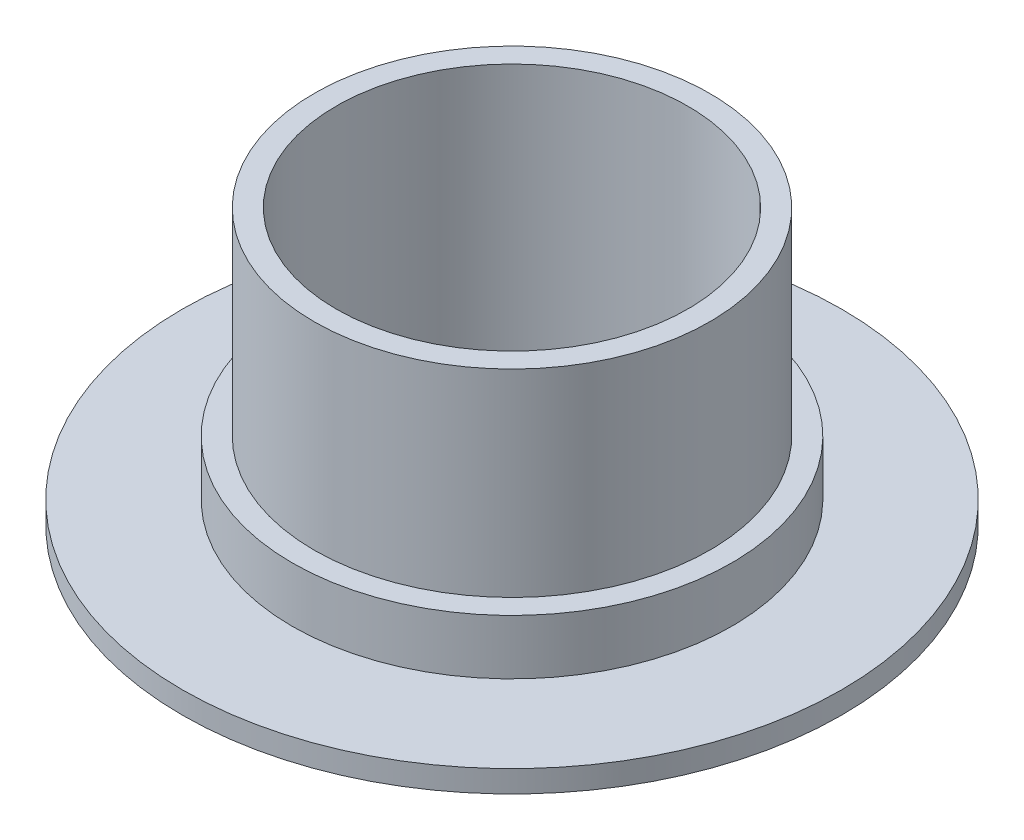
ISO-10303-21;
HEADER;
FILE_DESCRIPTION(('STEP AP214'),'2;1');
FILE_NAME('part.step','',(''),(''),'','','');
FILE_SCHEMA(('AUTOMOTIVE_DESIGN { 1 0 10303 214 1 1 1 1 }'));
ENDSEC;
DATA;
#1=APPLICATION_CONTEXT('core data for automotive mechanical design processes');
#2=APPLICATION_PROTOCOL_DEFINITION('international standard','automotive_design',2000,#1);
#3=PRODUCT_CONTEXT('',#1,'mechanical');
#4=PRODUCT('Part','Part','',(#3));
#5=PRODUCT_RELATED_PRODUCT_CATEGORY('part','',(#4));
#6=PRODUCT_DEFINITION_FORMATION('','',#4);
#7=PRODUCT_DEFINITION_CONTEXT('part definition',#1,'design');
#8=PRODUCT_DEFINITION('design','',#6,#7);
#9=PRODUCT_DEFINITION_SHAPE('','',#8);
#10=(LENGTH_UNIT() NAMED_UNIT(*) SI_UNIT(.MILLI.,.METRE.));
#11=(NAMED_UNIT(*) PLANE_ANGLE_UNIT() SI_UNIT($,.RADIAN.));
#12=(NAMED_UNIT(*) SI_UNIT($,.STERADIAN.) SOLID_ANGLE_UNIT());
#13=UNCERTAINTY_MEASURE_WITH_UNIT(LENGTH_MEASURE(1.E-05),#10,'distance_accuracy_value','');
#14=(GEOMETRIC_REPRESENTATION_CONTEXT(3) GLOBAL_UNCERTAINTY_ASSIGNED_CONTEXT((#13)) GLOBAL_UNIT_ASSIGNED_CONTEXT((#10,
#11,#12)) REPRESENTATION_CONTEXT('',''));
#15=CARTESIAN_POINT('',(0.,0.,0.));
#16=DIRECTION('',(0.,0.,1.));
#17=DIRECTION('',(1.,0.,0.));
#18=AXIS2_PLACEMENT_3D('',#15,#16,#17);
#19=CARTESIAN_POINT('',(0.,2.,0.));
#20=DIRECTION('',(0.,1.,0.));
#21=DIRECTION('',(0.,0.,1.));
#22=AXIS2_PLACEMENT_3D('',#19,#20,#21);
#23=PLANE('',#22);
#24=CARTESIAN_POINT('',(0.,2.,0.));
#25=DIRECTION('',(0.,1.,0.));
#26=DIRECTION('',(0.,0.,1.));
#27=AXIS2_PLACEMENT_3D('',#24,#25,#26);
#28=CIRCLE('',#27,30.);
#29=CARTESIAN_POINT('',(0.,2.,30.));
#30=VERTEX_POINT('',#29);
#31=EDGE_CURVE('E10',#30,#30,#28,.T.);
#32=ORIENTED_EDGE('',*,*,#31,.T.);
#33=EDGE_LOOP('',(#32));
#34=FACE_BOUND('',#33,.T.);
#35=CARTESIAN_POINT('',(0.,2.,0.));
#36=DIRECTION('',(0.,1.,0.));
#37=DIRECTION('',(0.,0.,1.));
#38=AXIS2_PLACEMENT_3D('',#35,#36,#37);
#39=CIRCLE('',#38,20.);
#40=CARTESIAN_POINT('',(0.,2.,20.));
#41=VERTEX_POINT('',#40);
#42=EDGE_CURVE('E46',#41,#41,#39,.T.);
#43=ORIENTED_EDGE('',*,*,#42,.F.);
#44=EDGE_LOOP('',(#43));
#45=FACE_BOUND('',#44,.T.);
#46=ADVANCED_FACE('F35',(#34,#45),#23,.T.);
#47=CARTESIAN_POINT('',(0.,0.,0.));
#48=DIRECTION('',(0.,1.,0.));
#49=DIRECTION('',(0.,0.,1.));
#50=AXIS2_PLACEMENT_3D('',#47,#48,#49);
#51=PLANE('',#50);
#52=CARTESIAN_POINT('',(0.,0.,0.));
#53=DIRECTION('',(0.,1.,0.));
#54=DIRECTION('',(0.,0.,1.));
#55=AXIS2_PLACEMENT_3D('',#52,#53,#54);
#56=CIRCLE('',#55,30.);
#57=CARTESIAN_POINT('',(0.,0.,30.));
#58=VERTEX_POINT('',#57);
#59=EDGE_CURVE('E39',#58,#58,#56,.T.);
#60=ORIENTED_EDGE('',*,*,#59,.F.);
#61=EDGE_LOOP('',(#60));
#62=FACE_BOUND('',#61,.T.);
#63=CARTESIAN_POINT('',(0.,0.,0.));
#64=DIRECTION('',(0.,1.,0.));
#65=DIRECTION('',(0.,0.,1.));
#66=AXIS2_PLACEMENT_3D('',#63,#64,#65);
#67=CIRCLE('',#66,16.);
#68=CARTESIAN_POINT('',(0.,0.,16.));
#69=VERTEX_POINT('',#68);
#70=EDGE_CURVE('E60',#69,#69,#67,.T.);
#71=ORIENTED_EDGE('',*,*,#70,.T.);
#72=EDGE_LOOP('',(#71));
#73=FACE_BOUND('',#72,.T.);
#74=ADVANCED_FACE('F86',(#62,#73),#51,.F.);
#75=CARTESIAN_POINT('',(0.,2.,0.));
#76=DIRECTION('',(0.,-1.,0.));
#77=DIRECTION('',(0.,0.,-1.));
#78=AXIS2_PLACEMENT_3D('',#75,#76,#77);
#79=CYLINDRICAL_SURFACE('',#78,30.);
#80=ORIENTED_EDGE('',*,*,#31,.F.);
#81=EDGE_LOOP('',(#80));
#82=FACE_BOUND('',#81,.T.);
#83=ORIENTED_EDGE('',*,*,#59,.T.);
#84=EDGE_LOOP('',(#83));
#85=FACE_BOUND('',#84,.T.);
#86=ADVANCED_FACE('F37',(#82,#85),#79,.T.);
#87=CARTESIAN_POINT('',(0.,7.,0.));
#88=DIRECTION('',(0.,1.,0.));
#89=DIRECTION('',(0.,0.,1.));
#90=AXIS2_PLACEMENT_3D('',#87,#88,#89);
#91=PLANE('',#90);
#92=CARTESIAN_POINT('',(0.,7.,0.));
#93=DIRECTION('',(0.,1.,0.));
#94=DIRECTION('',(0.,0.,1.));
#95=AXIS2_PLACEMENT_3D('',#92,#93,#94);
#96=CIRCLE('',#95,20.);
#97=CARTESIAN_POINT('',(0.,7.,20.));
#98=VERTEX_POINT('',#97);
#99=EDGE_CURVE('E50',#98,#98,#96,.T.);
#100=ORIENTED_EDGE('',*,*,#99,.T.);
#101=EDGE_LOOP('',(#100));
#102=FACE_BOUND('',#101,.T.);
#103=CARTESIAN_POINT('',(0.,7.,0.));
#104=DIRECTION('',(0.,1.,0.));
#105=DIRECTION('',(0.,0.,1.));
#106=AXIS2_PLACEMENT_3D('',#103,#104,#105);
#107=CIRCLE('',#106,18.);
#108=CARTESIAN_POINT('',(0.,7.,18.));
#109=VERTEX_POINT('',#108);
#110=EDGE_CURVE('E53',#109,#109,#107,.T.);
#111=ORIENTED_EDGE('',*,*,#110,.F.);
#112=EDGE_LOOP('',(#111));
#113=FACE_BOUND('',#112,.T.);
#114=ADVANCED_FACE('F81',(#102,#113),#91,.T.);
#115=CARTESIAN_POINT('',(0.,7.,0.));
#116=DIRECTION('',(0.,-1.,0.));
#117=DIRECTION('',(0.,0.,-1.));
#118=AXIS2_PLACEMENT_3D('',#115,#116,#117);
#119=CYLINDRICAL_SURFACE('',#118,20.);
#120=ORIENTED_EDGE('',*,*,#42,.T.);
#121=EDGE_LOOP('',(#120));
#122=FACE_BOUND('',#121,.T.);
#123=ORIENTED_EDGE('',*,*,#99,.F.);
#124=EDGE_LOOP('',(#123));
#125=FACE_BOUND('',#124,.T.);
#126=ADVANCED_FACE('F72',(#122,#125),#119,.T.);
#127=CARTESIAN_POINT('',(0.,25.,0.));
#128=DIRECTION('',(0.,1.,0.));
#129=DIRECTION('',(0.,0.,1.));
#130=AXIS2_PLACEMENT_3D('',#127,#128,#129);
#131=PLANE('',#130);
#132=CARTESIAN_POINT('',(0.,25.,0.));
#133=DIRECTION('',(0.,1.,0.));
#134=DIRECTION('',(0.,0.,1.));
#135=AXIS2_PLACEMENT_3D('',#132,#133,#134);
#136=CIRCLE('',#135,18.);
#137=CARTESIAN_POINT('',(0.,25.,18.));
#138=VERTEX_POINT('',#137);
#139=EDGE_CURVE('E56',#138,#138,#136,.T.);
#140=ORIENTED_EDGE('',*,*,#139,.T.);
#141=EDGE_LOOP('',(#140));
#142=FACE_BOUND('',#141,.T.);
#143=CARTESIAN_POINT('',(0.,25.,0.));
#144=DIRECTION('',(0.,1.,0.));
#145=DIRECTION('',(0.,0.,1.));
#146=AXIS2_PLACEMENT_3D('',#143,#144,#145);
#147=CIRCLE('',#146,16.);
#148=CARTESIAN_POINT('',(0.,25.,16.));
#149=VERTEX_POINT('',#148);
#150=EDGE_CURVE('E59',#149,#149,#147,.T.);
#151=ORIENTED_EDGE('',*,*,#150,.F.);
#152=EDGE_LOOP('',(#151));
#153=FACE_BOUND('',#152,.T.);
#154=ADVANCED_FACE('F69',(#142,#153),#131,.T.);
#155=CARTESIAN_POINT('',(0.,25.,0.));
#156=DIRECTION('',(0.,-1.,0.));
#157=DIRECTION('',(0.,0.,-1.));
#158=AXIS2_PLACEMENT_3D('',#155,#156,#157);
#159=CYLINDRICAL_SURFACE('',#158,18.);
#160=ORIENTED_EDGE('',*,*,#110,.T.);
#161=EDGE_LOOP('',(#160));
#162=FACE_BOUND('',#161,.T.);
#163=ORIENTED_EDGE('',*,*,#139,.F.);
#164=EDGE_LOOP('',(#163));
#165=FACE_BOUND('',#164,.T.);
#166=ADVANCED_FACE('F71',(#162,#165),#159,.T.);
#167=CARTESIAN_POINT('',(0.,25.,0.));
#168=DIRECTION('',(0.,-1.,0.));
#169=DIRECTION('',(0.,0.,-1.));
#170=AXIS2_PLACEMENT_3D('',#167,#168,#169);
#171=CYLINDRICAL_SURFACE('',#170,16.);
#172=ORIENTED_EDGE('',*,*,#150,.T.);
#173=EDGE_LOOP('',(#172));
#174=FACE_BOUND('',#173,.T.);
#175=ORIENTED_EDGE('',*,*,#70,.F.);
#176=EDGE_LOOP('',(#175));
#177=FACE_BOUND('',#176,.T.);
#178=ADVANCED_FACE('F66',(#174,#177),#171,.F.);
#179=CLOSED_SHELL('',(#46,#74,#86,#114,#126,#154,#166,#178));
#180=MANIFOLD_SOLID_BREP('B2',#179);
#181=ADVANCED_BREP_SHAPE_REPRESENTATION('',(#18,#180),#14);
#182=SHAPE_DEFINITION_REPRESENTATION(#9,#181);
ENDSEC;
END-ISO-10303-21;
